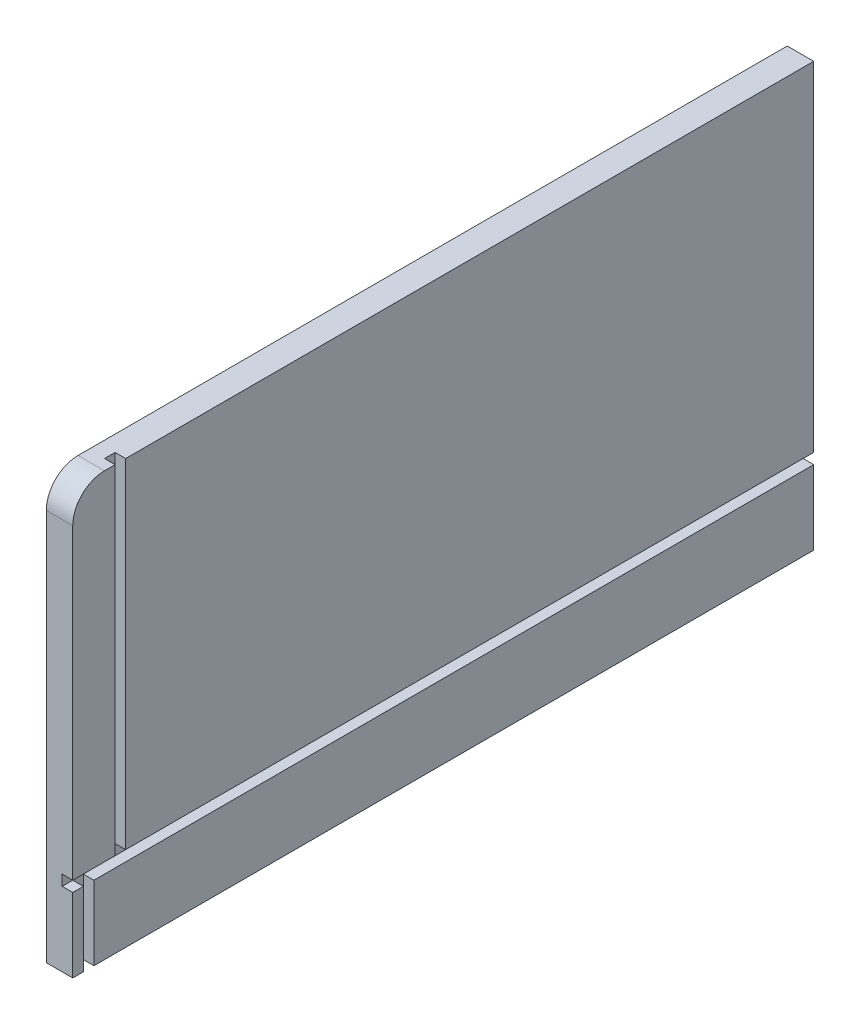
ISO-10303-21;
HEADER;
FILE_DESCRIPTION(('STEP AP214'),'2;1');
FILE_NAME('part.step','',(''),(''),'','','');
FILE_SCHEMA(('AUTOMOTIVE_DESIGN { 1 0 10303 214 1 1 1 1 }'));
ENDSEC;
DATA;
#1=APPLICATION_CONTEXT('core data for automotive mechanical design processes');
#2=APPLICATION_PROTOCOL_DEFINITION('international standard','automotive_design',2000,#1);
#3=PRODUCT_CONTEXT('',#1,'mechanical');
#4=PRODUCT('Part','Part','',(#3));
#5=PRODUCT_RELATED_PRODUCT_CATEGORY('part','',(#4));
#6=PRODUCT_DEFINITION_FORMATION('','',#4);
#7=PRODUCT_DEFINITION_CONTEXT('part definition',#1,'design');
#8=PRODUCT_DEFINITION('design','',#6,#7);
#9=PRODUCT_DEFINITION_SHAPE('','',#8);
#10=(LENGTH_UNIT() NAMED_UNIT(*) SI_UNIT(.MILLI.,.METRE.));
#11=(NAMED_UNIT(*) PLANE_ANGLE_UNIT() SI_UNIT($,.RADIAN.));
#12=(NAMED_UNIT(*) SI_UNIT($,.STERADIAN.) SOLID_ANGLE_UNIT());
#13=UNCERTAINTY_MEASURE_WITH_UNIT(LENGTH_MEASURE(1.E-05),#10,'distance_accuracy_value','');
#14=(GEOMETRIC_REPRESENTATION_CONTEXT(3) GLOBAL_UNCERTAINTY_ASSIGNED_CONTEXT((#13)) GLOBAL_UNIT_ASSIGNED_CONTEXT((#10,
#11,#12)) REPRESENTATION_CONTEXT('',''));
#15=CARTESIAN_POINT('',(0.,0.,0.));
#16=DIRECTION('',(0.,0.,1.));
#17=DIRECTION('',(1.,0.,0.));
#18=AXIS2_PLACEMENT_3D('',#15,#16,#17);
#19=CARTESIAN_POINT('',(15.875,234.95,-19.05));
#20=DIRECTION('',(-1.,0.,0.));
#21=DIRECTION('',(0.,0.,1.));
#22=AXIS2_PLACEMENT_3D('',#19,#20,#21);
#23=PLANE('',#22);
#24=DIRECTION('',(0.,0.,-1.));
#25=VECTOR('',#24,1.);
#26=CARTESIAN_POINT('',(15.875,50.8,0.));
#27=LINE('',#26,#25);
#28=CARTESIAN_POINT('',(15.875,50.8,0.));
#29=VERTEX_POINT('',#28);
#30=CARTESIAN_POINT('',(15.875,50.8,-25.4));
#31=VERTEX_POINT('',#30);
#32=EDGE_CURVE('E178',#29,#31,#27,.T.);
#33=ORIENTED_EDGE('',*,*,#32,.T.);
#34=DIRECTION('',(0.,1.,0.));
#35=VECTOR('',#34,1.);
#36=CARTESIAN_POINT('',(15.875,-0.000999999999973245,-25.4));
#37=LINE('',#36,#35);
#38=CARTESIAN_POINT('',(15.875,254.,-25.4));
#39=VERTEX_POINT('',#38);
#40=EDGE_CURVE('E163',#31,#39,#37,.T.);
#41=ORIENTED_EDGE('',*,*,#40,.T.);
#42=DIRECTION('',(0.,0.,1.));
#43=VECTOR('',#42,1.);
#44=CARTESIAN_POINT('',(15.875,254.,-19.05));
#45=LINE('',#44,#43);
#46=CARTESIAN_POINT('',(15.875,254.,-19.05));
#47=VERTEX_POINT('',#46);
#48=EDGE_CURVE('E209',#39,#47,#45,.T.);
#49=ORIENTED_EDGE('',*,*,#48,.T.);
#50=CARTESIAN_POINT('',(15.875,234.95,-19.05));
#51=DIRECTION('',(1.,0.,0.));
#52=DIRECTION('',(0.,0.,1.));
#53=AXIS2_PLACEMENT_3D('',#50,#51,#52);
#54=CIRCLE('',#53,19.05);
#55=CARTESIAN_POINT('',(15.875,234.95,0.));
#56=VERTEX_POINT('',#55);
#57=EDGE_CURVE('E211',#47,#56,#54,.T.);
#58=ORIENTED_EDGE('',*,*,#57,.T.);
#59=DIRECTION('',(0.,-1.,0.));
#60=VECTOR('',#59,1.);
#61=CARTESIAN_POINT('',(15.875,0.,0.));
#62=LINE('',#61,#60);
#63=EDGE_CURVE('E197',#56,#29,#62,.T.);
#64=ORIENTED_EDGE('',*,*,#63,.T.);
#65=EDGE_LOOP('',(#33,#41,#49,#58,#64));
#66=FACE_BOUND('',#65,.T.);
#67=ADVANCED_FACE('F33',(#66),#23,.F.);
#68=CARTESIAN_POINT('',(15.875,50.8,0.));
#69=DIRECTION('',(0.,1.,0.));
#70=DIRECTION('',(0.,0.,1.));
#71=AXIS2_PLACEMENT_3D('',#68,#69,#70);
#72=PLANE('',#71);
#73=DIRECTION('',(0.,0.,-1.));
#74=VECTOR('',#73,1.);
#75=CARTESIAN_POINT('',(9.525,50.8,0.));
#76=LINE('',#75,#74);
#77=CARTESIAN_POINT('',(9.525,50.8,0.));
#78=VERTEX_POINT('',#77);
#79=CARTESIAN_POINT('',(9.525,50.8,-25.4));
#80=VERTEX_POINT('',#79);
#81=EDGE_CURVE('E179',#78,#80,#76,.T.);
#82=ORIENTED_EDGE('',*,*,#81,.T.);
#83=DIRECTION('',(-1.,0.,0.));
#84=VECTOR('',#83,1.);
#85=CARTESIAN_POINT('',(15.875,50.8,-25.4));
#86=LINE('',#85,#84);
#87=EDGE_CURVE('E48',#31,#80,#86,.T.);
#88=ORIENTED_EDGE('',*,*,#87,.F.);
#89=ORIENTED_EDGE('',*,*,#32,.F.);
#90=DIRECTION('',(1.,0.,0.));
#91=VECTOR('',#90,1.);
#92=CARTESIAN_POINT('',(15.875,50.8,0.));
#93=LINE('',#92,#91);
#94=EDGE_CURVE('E295',#78,#29,#93,.T.);
#95=ORIENTED_EDGE('',*,*,#94,.F.);
#96=EDGE_LOOP('',(#82,#88,#89,#95));
#97=FACE_BOUND('',#96,.T.);
#98=ADVANCED_FACE('F329',(#97),#72,.F.);
#99=DIRECTION('',(0.,0.,-1.));
#100=VECTOR('',#99,1.);
#101=CARTESIAN_POINT('',(15.875,0.,0.));
#102=LINE('',#101,#100);
#103=CARTESIAN_POINT('',(15.875,0.,0.));
#104=VERTEX_POINT('',#103);
#105=CARTESIAN_POINT('',(15.875,0.,-6.35));
#106=VERTEX_POINT('',#105);
#107=EDGE_CURVE('E202',#104,#106,#102,.T.);
#108=ORIENTED_EDGE('',*,*,#107,.T.);
#109=DIRECTION('',(0.,-1.,0.));
#110=VECTOR('',#109,1.);
#111=CARTESIAN_POINT('',(15.875,254.001,-6.35));
#112=LINE('',#111,#110);
#113=CARTESIAN_POINT('',(15.875,44.45,-6.35));
#114=VERTEX_POINT('',#113);
#115=EDGE_CURVE('E283',#114,#106,#112,.T.);
#116=ORIENTED_EDGE('',*,*,#115,.F.);
#117=DIRECTION('',(0.,0.,-1.));
#118=VECTOR('',#117,1.);
#119=CARTESIAN_POINT('',(15.875,44.45,0.));
#120=LINE('',#119,#118);
#121=CARTESIAN_POINT('',(15.875,44.45,0.));
#122=VERTEX_POINT('',#121);
#123=EDGE_CURVE('E193',#122,#114,#120,.T.);
#124=ORIENTED_EDGE('',*,*,#123,.F.);
#125=EDGE_CURVE('E201',#122,#104,#62,.T.);
#126=ORIENTED_EDGE('',*,*,#125,.T.);
#127=EDGE_LOOP('',(#108,#116,#124,#126));
#128=FACE_BOUND('',#127,.T.);
#129=ADVANCED_FACE('F323',(#128),#23,.F.);
#130=CARTESIAN_POINT('',(15.875,44.45,0.));
#131=DIRECTION('',(0.,-1.,0.));
#132=DIRECTION('',(0.,0.,-1.));
#133=AXIS2_PLACEMENT_3D('',#130,#131,#132);
#134=PLANE('',#133);
#135=ORIENTED_EDGE('',*,*,#123,.T.);
#136=DIRECTION('',(1.,0.,0.));
#137=VECTOR('',#136,1.);
#138=CARTESIAN_POINT('',(15.875,44.45,-6.35));
#139=LINE('',#138,#137);
#140=CARTESIAN_POINT('',(9.525,44.45,-6.35));
#141=VERTEX_POINT('',#140);
#142=EDGE_CURVE('E270',#141,#114,#139,.T.);
#143=ORIENTED_EDGE('',*,*,#142,.F.);
#144=DIRECTION('',(0.,0.,-1.));
#145=VECTOR('',#144,1.);
#146=CARTESIAN_POINT('',(9.525,44.45,0.));
#147=LINE('',#146,#145);
#148=CARTESIAN_POINT('',(9.525,44.45,0.));
#149=VERTEX_POINT('',#148);
#150=EDGE_CURVE('E189',#149,#141,#147,.T.);
#151=ORIENTED_EDGE('',*,*,#150,.F.);
#152=DIRECTION('',(-1.,0.,0.));
#153=VECTOR('',#152,1.);
#154=CARTESIAN_POINT('',(15.875,44.45,0.));
#155=LINE('',#154,#153);
#156=EDGE_CURVE('E289',#122,#149,#155,.T.);
#157=ORIENTED_EDGE('',*,*,#156,.F.);
#158=EDGE_LOOP('',(#135,#143,#151,#157));
#159=FACE_BOUND('',#158,.T.);
#160=ADVANCED_FACE('F348',(#159),#134,.F.);
#161=CARTESIAN_POINT('',(15.875,254.,-444.5));
#162=VERTEX_POINT('',#161);
#163=CARTESIAN_POINT('',(15.875,254.,-31.75));
#164=VERTEX_POINT('',#163);
#165=EDGE_CURVE('E171',#162,#164,#45,.T.);
#166=ORIENTED_EDGE('',*,*,#165,.T.);
#167=DIRECTION('',(0.,1.,0.));
#168=VECTOR('',#167,1.);
#169=CARTESIAN_POINT('',(15.875,-0.000999999999973245,-31.75));
#170=LINE('',#169,#168);
#171=CARTESIAN_POINT('',(15.875,50.8,-31.75));
#172=VERTEX_POINT('',#171);
#173=EDGE_CURVE('E156',#172,#164,#170,.T.);
#174=ORIENTED_EDGE('',*,*,#173,.F.);
#175=CARTESIAN_POINT('',(15.875,50.8,-444.5));
#176=VERTEX_POINT('',#175);
#177=EDGE_CURVE('E168',#172,#176,#27,.T.);
#178=ORIENTED_EDGE('',*,*,#177,.T.);
#179=DIRECTION('',(0.,1.,0.));
#180=VECTOR('',#179,1.);
#181=CARTESIAN_POINT('',(15.875,0.,-444.5));
#182=LINE('',#181,#180);
#183=EDGE_CURVE('E205',#176,#162,#182,.T.);
#184=ORIENTED_EDGE('',*,*,#183,.T.);
#185=EDGE_LOOP('',(#166,#174,#178,#184));
#186=FACE_BOUND('',#185,.T.);
#187=ADVANCED_FACE('F167',(#186),#23,.F.);
#188=CARTESIAN_POINT('',(15.875,0.,0.));
#189=DIRECTION('',(0.,0.,-1.));
#190=DIRECTION('',(-1.,0.,0.));
#191=AXIS2_PLACEMENT_3D('',#188,#189,#190);
#192=PLANE('',#191);
#193=DIRECTION('',(0.,1.,0.));
#194=VECTOR('',#193,1.);
#195=CARTESIAN_POINT('',(9.525,50.8,0.));
#196=LINE('',#195,#194);
#197=EDGE_CURVE('E292',#149,#78,#196,.T.);
#198=ORIENTED_EDGE('',*,*,#197,.T.);
#199=ORIENTED_EDGE('',*,*,#94,.T.);
#200=ORIENTED_EDGE('',*,*,#63,.F.);
#201=DIRECTION('',(-1.,0.,0.));
#202=VECTOR('',#201,1.);
#203=CARTESIAN_POINT('',(15.875,234.95,0.));
#204=LINE('',#203,#202);
#205=CARTESIAN_POINT('',(0.,234.95,0.));
#206=VERTEX_POINT('',#205);
#207=EDGE_CURVE('E213',#56,#206,#204,.T.);
#208=ORIENTED_EDGE('',*,*,#207,.T.);
#209=DIRECTION('',(0.,-1.,0.));
#210=VECTOR('',#209,1.);
#211=CARTESIAN_POINT('',(0.,0.,0.));
#212=LINE('',#211,#210);
#213=CARTESIAN_POINT('',(0.,0.,0.));
#214=VERTEX_POINT('',#213);
#215=EDGE_CURVE('E182',#206,#214,#212,.T.);
#216=ORIENTED_EDGE('',*,*,#215,.T.);
#217=DIRECTION('',(-1.,0.,0.));
#218=VECTOR('',#217,1.);
#219=CARTESIAN_POINT('',(15.875,0.,0.));
#220=LINE('',#219,#218);
#221=EDGE_CURVE('E11',#104,#214,#220,.T.);
#222=ORIENTED_EDGE('',*,*,#221,.F.);
#223=ORIENTED_EDGE('',*,*,#125,.F.);
#224=ORIENTED_EDGE('',*,*,#156,.T.);
#225=EDGE_LOOP('',(#198,#199,#200,#208,#216,#222,#223,#224));
#226=FACE_BOUND('',#225,.T.);
#227=ADVANCED_FACE('F35',(#226),#192,.F.);
#228=CARTESIAN_POINT('',(15.875,0.,0.));
#229=DIRECTION('',(0.,1.,0.));
#230=DIRECTION('',(0.,0.,1.));
#231=AXIS2_PLACEMENT_3D('',#228,#229,#230);
#232=PLANE('',#231);
#233=DIRECTION('',(0.,0.,-1.));
#234=VECTOR('',#233,1.);
#235=CARTESIAN_POINT('',(9.525,0.,-6.35));
#236=LINE('',#235,#234);
#237=CARTESIAN_POINT('',(9.525,0.,-6.35));
#238=VERTEX_POINT('',#237);
#239=CARTESIAN_POINT('',(9.525,0.,-12.7));
#240=VERTEX_POINT('',#239);
#241=EDGE_CURVE('E276',#238,#240,#236,.T.);
#242=ORIENTED_EDGE('',*,*,#241,.F.);
#243=DIRECTION('',(-1.,0.,0.));
#244=VECTOR('',#243,1.);
#245=CARTESIAN_POINT('',(15.875,0.,-6.35));
#246=LINE('',#245,#244);
#247=EDGE_CURVE('E272',#106,#238,#246,.T.);
#248=ORIENTED_EDGE('',*,*,#247,.F.);
#249=ORIENTED_EDGE('',*,*,#107,.F.);
#250=ORIENTED_EDGE('',*,*,#221,.T.);
#251=DIRECTION('',(0.,0.,-1.));
#252=VECTOR('',#251,1.);
#253=CARTESIAN_POINT('',(0.,0.,0.));
#254=LINE('',#253,#252);
#255=CARTESIAN_POINT('',(0.,0.,-444.5));
#256=VERTEX_POINT('',#255);
#257=EDGE_CURVE('E216',#214,#256,#254,.T.);
#258=ORIENTED_EDGE('',*,*,#257,.T.);
#259=DIRECTION('',(-1.,0.,0.));
#260=VECTOR('',#259,1.);
#261=CARTESIAN_POINT('',(15.875,0.,-444.5));
#262=LINE('',#261,#260);
#263=CARTESIAN_POINT('',(15.875,0.,-444.5));
#264=VERTEX_POINT('',#263);
#265=EDGE_CURVE('E41',#264,#256,#262,.T.);
#266=ORIENTED_EDGE('',*,*,#265,.F.);
#267=CARTESIAN_POINT('',(15.875,0.,-12.7));
#268=VERTEX_POINT('',#267);
#269=EDGE_CURVE('E200',#268,#264,#102,.T.);
#270=ORIENTED_EDGE('',*,*,#269,.F.);
#271=DIRECTION('',(1.,0.,0.));
#272=VECTOR('',#271,1.);
#273=CARTESIAN_POINT('',(15.875,0.,-12.7));
#274=LINE('',#273,#272);
#275=EDGE_CURVE('E273',#240,#268,#274,.T.);
#276=ORIENTED_EDGE('',*,*,#275,.F.);
#277=EDGE_LOOP('',(#242,#248,#249,#250,#258,#266,#270,#276));
#278=FACE_BOUND('',#277,.T.);
#279=ADVANCED_FACE('F312',(#278),#232,.F.);
#280=CARTESIAN_POINT('',(15.875,0.,-444.5));
#281=DIRECTION('',(0.,0.,1.));
#282=DIRECTION('',(1.,0.,0.));
#283=AXIS2_PLACEMENT_3D('',#280,#281,#282);
#284=PLANE('',#283);
#285=ORIENTED_EDGE('',*,*,#183,.F.);
#286=DIRECTION('',(1.,0.,0.));
#287=VECTOR('',#286,1.);
#288=CARTESIAN_POINT('',(15.875,50.8,-444.5));
#289=LINE('',#288,#287);
#290=CARTESIAN_POINT('',(9.525,50.8,-444.5));
#291=VERTEX_POINT('',#290);
#292=EDGE_CURVE('E176',#291,#176,#289,.T.);
#293=ORIENTED_EDGE('',*,*,#292,.F.);
#294=DIRECTION('',(0.,1.,0.));
#295=VECTOR('',#294,1.);
#296=CARTESIAN_POINT('',(9.525,50.8,-444.5));
#297=LINE('',#296,#295);
#298=CARTESIAN_POINT('',(9.525,44.45,-444.5));
#299=VERTEX_POINT('',#298);
#300=EDGE_CURVE('E299',#299,#291,#297,.T.);
#301=ORIENTED_EDGE('',*,*,#300,.F.);
#302=DIRECTION('',(-1.,0.,0.));
#303=VECTOR('',#302,1.);
#304=CARTESIAN_POINT('',(15.875,44.45,-444.5));
#305=LINE('',#304,#303);
#306=CARTESIAN_POINT('',(15.875,44.45,-444.5));
#307=VERTEX_POINT('',#306);
#308=EDGE_CURVE('E288',#307,#299,#305,.T.);
#309=ORIENTED_EDGE('',*,*,#308,.F.);
#310=EDGE_CURVE('E206',#264,#307,#182,.T.);
#311=ORIENTED_EDGE('',*,*,#310,.F.);
#312=ORIENTED_EDGE('',*,*,#265,.T.);
#313=DIRECTION('',(0.,1.,0.));
#314=VECTOR('',#313,1.);
#315=CARTESIAN_POINT('',(0.,0.,-444.5));
#316=LINE('',#315,#314);
#317=CARTESIAN_POINT('',(0.,254.,-444.5));
#318=VERTEX_POINT('',#317);
#319=EDGE_CURVE('E218',#256,#318,#316,.T.);
#320=ORIENTED_EDGE('',*,*,#319,.T.);
#321=DIRECTION('',(-1.,0.,0.));
#322=VECTOR('',#321,1.);
#323=CARTESIAN_POINT('',(15.875,254.,-444.5));
#324=LINE('',#323,#322);
#325=EDGE_CURVE('E229',#162,#318,#324,.T.);
#326=ORIENTED_EDGE('',*,*,#325,.F.);
#327=EDGE_LOOP('',(#285,#293,#301,#309,#311,#312,#320,#326));
#328=FACE_BOUND('',#327,.T.);
#329=ADVANCED_FACE('F236',(#328),#284,.F.);
#330=CARTESIAN_POINT('',(15.875,254.,-19.05));
#331=DIRECTION('',(0.,-1.,0.));
#332=DIRECTION('',(0.,0.,-1.));
#333=AXIS2_PLACEMENT_3D('',#330,#331,#332);
#334=PLANE('',#333);
#335=ORIENTED_EDGE('',*,*,#48,.F.);
#336=DIRECTION('',(1.,0.,0.));
#337=VECTOR('',#336,1.);
#338=CARTESIAN_POINT('',(15.875,254.,-25.4));
#339=LINE('',#338,#337);
#340=CARTESIAN_POINT('',(9.525,254.,-25.4));
#341=VERTEX_POINT('',#340);
#342=EDGE_CURVE('E172',#341,#39,#339,.T.);
#343=ORIENTED_EDGE('',*,*,#342,.F.);
#344=DIRECTION('',(0.,0.,1.));
#345=VECTOR('',#344,1.);
#346=CARTESIAN_POINT('',(9.525,254.,-25.4));
#347=LINE('',#346,#345);
#348=CARTESIAN_POINT('',(9.525,254.,-31.75));
#349=VERTEX_POINT('',#348);
#350=EDGE_CURVE('E260',#349,#341,#347,.T.);
#351=ORIENTED_EDGE('',*,*,#350,.F.);
#352=DIRECTION('',(-1.,0.,0.));
#353=VECTOR('',#352,1.);
#354=CARTESIAN_POINT('',(15.875,254.,-31.75));
#355=LINE('',#354,#353);
#356=EDGE_CURVE('E262',#164,#349,#355,.T.);
#357=ORIENTED_EDGE('',*,*,#356,.F.);
#358=ORIENTED_EDGE('',*,*,#165,.F.);
#359=ORIENTED_EDGE('',*,*,#325,.T.);
#360=DIRECTION('',(0.,0.,1.));
#361=VECTOR('',#360,1.);
#362=CARTESIAN_POINT('',(0.,254.,-19.05));
#363=LINE('',#362,#361);
#364=CARTESIAN_POINT('',(0.,254.,-19.05));
#365=VERTEX_POINT('',#364);
#366=EDGE_CURVE('E220',#318,#365,#363,.T.);
#367=ORIENTED_EDGE('',*,*,#366,.T.);
#368=DIRECTION('',(-1.,0.,0.));
#369=VECTOR('',#368,1.);
#370=CARTESIAN_POINT('',(15.875,254.,-19.05));
#371=LINE('',#370,#369);
#372=EDGE_CURVE('E226',#47,#365,#371,.T.);
#373=ORIENTED_EDGE('',*,*,#372,.F.);
#374=EDGE_LOOP('',(#335,#343,#351,#357,#358,#359,#367,#373));
#375=FACE_BOUND('',#374,.T.);
#376=ADVANCED_FACE('F249',(#375),#334,.F.);
#377=CARTESIAN_POINT('',(15.875,234.95,-19.05));
#378=DIRECTION('',(-1.,0.,0.));
#379=DIRECTION('',(0.,0.,1.));
#380=AXIS2_PLACEMENT_3D('',#377,#378,#379);
#381=CYLINDRICAL_SURFACE('',#380,19.05);
#382=CARTESIAN_POINT('',(0.,234.95,-19.05));
#383=DIRECTION('',(1.,0.,0.));
#384=DIRECTION('',(0.,0.,1.));
#385=AXIS2_PLACEMENT_3D('',#382,#383,#384);
#386=CIRCLE('',#385,19.05);
#387=EDGE_CURVE('E222',#365,#206,#386,.T.);
#388=ORIENTED_EDGE('',*,*,#387,.T.);
#389=ORIENTED_EDGE('',*,*,#207,.F.);
#390=ORIENTED_EDGE('',*,*,#57,.F.);
#391=ORIENTED_EDGE('',*,*,#372,.T.);
#392=EDGE_LOOP('',(#388,#389,#390,#391));
#393=FACE_BOUND('',#392,.T.);
#394=ADVANCED_FACE('F252',(#393),#381,.T.);
#395=CARTESIAN_POINT('',(15.875,44.45,-12.7));
#396=VERTEX_POINT('',#395);
#397=EDGE_CURVE('E196',#396,#307,#120,.T.);
#398=ORIENTED_EDGE('',*,*,#397,.F.);
#399=DIRECTION('',(0.,-1.,0.));
#400=VECTOR('',#399,1.);
#401=CARTESIAN_POINT('',(15.875,254.001,-12.7));
#402=LINE('',#401,#400);
#403=EDGE_CURVE('E56',#396,#268,#402,.T.);
#404=ORIENTED_EDGE('',*,*,#403,.T.);
#405=ORIENTED_EDGE('',*,*,#269,.T.);
#406=ORIENTED_EDGE('',*,*,#310,.T.);
#407=EDGE_LOOP('',(#398,#404,#405,#406));
#408=FACE_BOUND('',#407,.T.);
#409=ADVANCED_FACE('F309',(#408),#23,.F.);
#410=CARTESIAN_POINT('',(0.,234.95,-19.05));
#411=DIRECTION('',(-1.,0.,0.));
#412=DIRECTION('',(0.,0.,1.));
#413=AXIS2_PLACEMENT_3D('',#410,#411,#412);
#414=PLANE('',#413);
#415=ORIENTED_EDGE('',*,*,#215,.F.);
#416=ORIENTED_EDGE('',*,*,#387,.F.);
#417=ORIENTED_EDGE('',*,*,#366,.F.);
#418=ORIENTED_EDGE('',*,*,#319,.F.);
#419=ORIENTED_EDGE('',*,*,#257,.F.);
#420=EDGE_LOOP('',(#415,#416,#417,#418,#419));
#421=FACE_BOUND('',#420,.T.);
#422=ADVANCED_FACE('F244',(#421),#414,.T.);
#423=ORIENTED_EDGE('',*,*,#177,.F.);
#424=DIRECTION('',(1.,0.,0.));
#425=VECTOR('',#424,1.);
#426=CARTESIAN_POINT('',(15.875,50.8,-31.75));
#427=LINE('',#426,#425);
#428=CARTESIAN_POINT('',(9.525,50.8,-31.75));
#429=VERTEX_POINT('',#428);
#430=EDGE_CURVE('E152',#429,#172,#427,.T.);
#431=ORIENTED_EDGE('',*,*,#430,.F.);
#432=EDGE_CURVE('E184',#429,#291,#76,.T.);
#433=ORIENTED_EDGE('',*,*,#432,.T.);
#434=ORIENTED_EDGE('',*,*,#292,.T.);
#435=EDGE_LOOP('',(#423,#431,#433,#434));
#436=FACE_BOUND('',#435,.T.);
#437=ADVANCED_FACE('F174',(#436),#72,.F.);
#438=CARTESIAN_POINT('',(9.525,50.8,0.));
#439=DIRECTION('',(-1.,0.,0.));
#440=DIRECTION('',(0.,-1.,0.));
#441=AXIS2_PLACEMENT_3D('',#438,#439,#440);
#442=PLANE('',#441);
#443=ORIENTED_EDGE('',*,*,#300,.T.);
#444=ORIENTED_EDGE('',*,*,#432,.F.);
#445=DIRECTION('',(0.,1.,0.));
#446=VECTOR('',#445,1.);
#447=CARTESIAN_POINT('',(9.525,-0.000999999999973245,-31.75));
#448=LINE('',#447,#446);
#449=EDGE_CURVE('E158',#429,#349,#448,.T.);
#450=ORIENTED_EDGE('',*,*,#449,.T.);
#451=ORIENTED_EDGE('',*,*,#350,.T.);
#452=DIRECTION('',(0.,1.,0.));
#453=VECTOR('',#452,1.);
#454=CARTESIAN_POINT('',(9.525,-0.000999999999973245,-25.4));
#455=LINE('',#454,#453);
#456=EDGE_CURVE('E267',#80,#341,#455,.T.);
#457=ORIENTED_EDGE('',*,*,#456,.F.);
#458=ORIENTED_EDGE('',*,*,#81,.F.);
#459=ORIENTED_EDGE('',*,*,#197,.F.);
#460=ORIENTED_EDGE('',*,*,#150,.T.);
#461=DIRECTION('',(0.,-1.,0.));
#462=VECTOR('',#461,1.);
#463=CARTESIAN_POINT('',(9.525,254.001,-6.35));
#464=LINE('',#463,#462);
#465=EDGE_CURVE('E275',#141,#238,#464,.T.);
#466=ORIENTED_EDGE('',*,*,#465,.T.);
#467=ORIENTED_EDGE('',*,*,#241,.T.);
#468=DIRECTION('',(0.,-1.,0.));
#469=VECTOR('',#468,1.);
#470=CARTESIAN_POINT('',(9.525,254.001,-12.7));
#471=LINE('',#470,#469);
#472=CARTESIAN_POINT('',(9.525,44.45,-12.7));
#473=VERTEX_POINT('',#472);
#474=EDGE_CURVE('E284',#473,#240,#471,.T.);
#475=ORIENTED_EDGE('',*,*,#474,.F.);
#476=EDGE_CURVE('E192',#473,#299,#147,.T.);
#477=ORIENTED_EDGE('',*,*,#476,.T.);
#478=EDGE_LOOP('',(#443,#444,#450,#451,#457,#458,#459,#460,#466,#467,#475,#477));
#479=FACE_BOUND('',#478,.T.);
#480=ADVANCED_FACE('F303',(#479),#442,.F.);
#481=ORIENTED_EDGE('',*,*,#476,.F.);
#482=DIRECTION('',(-1.,0.,0.));
#483=VECTOR('',#482,1.);
#484=CARTESIAN_POINT('',(15.875,44.45,-12.7));
#485=LINE('',#484,#483);
#486=EDGE_CURVE('E162',#396,#473,#485,.T.);
#487=ORIENTED_EDGE('',*,*,#486,.F.);
#488=ORIENTED_EDGE('',*,*,#397,.T.);
#489=ORIENTED_EDGE('',*,*,#308,.T.);
#490=EDGE_LOOP('',(#481,#487,#488,#489));
#491=FACE_BOUND('',#490,.T.);
#492=ADVANCED_FACE('F361',(#491),#134,.F.);
#493=CARTESIAN_POINT('',(15.875,254.001,-6.35));
#494=DIRECTION('',(0.,0.,1.));
#495=DIRECTION('',(1.,0.,0.));
#496=AXIS2_PLACEMENT_3D('',#493,#494,#495);
#497=PLANE('',#496);
#498=ORIENTED_EDGE('',*,*,#142,.T.);
#499=ORIENTED_EDGE('',*,*,#115,.T.);
#500=ORIENTED_EDGE('',*,*,#247,.T.);
#501=ORIENTED_EDGE('',*,*,#465,.F.);
#502=EDGE_LOOP('',(#498,#499,#500,#501));
#503=FACE_BOUND('',#502,.T.);
#504=ADVANCED_FACE('F318',(#503),#497,.F.);
#505=CARTESIAN_POINT('',(15.875,254.001,-12.7));
#506=DIRECTION('',(0.,0.,-1.));
#507=DIRECTION('',(-1.,0.,0.));
#508=AXIS2_PLACEMENT_3D('',#505,#506,#507);
#509=PLANE('',#508);
#510=ORIENTED_EDGE('',*,*,#486,.T.);
#511=ORIENTED_EDGE('',*,*,#474,.T.);
#512=ORIENTED_EDGE('',*,*,#275,.T.);
#513=ORIENTED_EDGE('',*,*,#403,.F.);
#514=EDGE_LOOP('',(#510,#511,#512,#513));
#515=FACE_BOUND('',#514,.T.);
#516=ADVANCED_FACE('F314',(#515),#509,.F.);
#517=CARTESIAN_POINT('',(15.875,-0.000999999999973245,-25.4));
#518=DIRECTION('',(0.,0.,1.));
#519=DIRECTION('',(1.,0.,0.));
#520=AXIS2_PLACEMENT_3D('',#517,#518,#519);
#521=PLANE('',#520);
#522=ORIENTED_EDGE('',*,*,#87,.T.);
#523=ORIENTED_EDGE('',*,*,#456,.T.);
#524=ORIENTED_EDGE('',*,*,#342,.T.);
#525=ORIENTED_EDGE('',*,*,#40,.F.);
#526=EDGE_LOOP('',(#522,#523,#524,#525));
#527=FACE_BOUND('',#526,.T.);
#528=ADVANCED_FACE('F330',(#527),#521,.F.);
#529=CARTESIAN_POINT('',(15.875,-0.000999999999973245,-31.75));
#530=DIRECTION('',(0.,0.,-1.));
#531=DIRECTION('',(-1.,0.,0.));
#532=AXIS2_PLACEMENT_3D('',#529,#530,#531);
#533=PLANE('',#532);
#534=ORIENTED_EDGE('',*,*,#430,.T.);
#535=ORIENTED_EDGE('',*,*,#173,.T.);
#536=ORIENTED_EDGE('',*,*,#356,.T.);
#537=ORIENTED_EDGE('',*,*,#449,.F.);
#538=EDGE_LOOP('',(#534,#535,#536,#537));
#539=FACE_BOUND('',#538,.T.);
#540=ADVANCED_FACE('F154',(#539),#533,.F.);
#541=CLOSED_SHELL('',(#67,#98,#129,#160,#187,#227,#279,#329,#376,#394,#409,#422,#437,#480,#492,
#504,#516,#528,#540));
#542=MANIFOLD_SOLID_BREP('B2',#541);
#543=ADVANCED_BREP_SHAPE_REPRESENTATION('',(#18,#542),#14);
#544=SHAPE_DEFINITION_REPRESENTATION(#9,#543);
ENDSEC;
END-ISO-10303-21;
